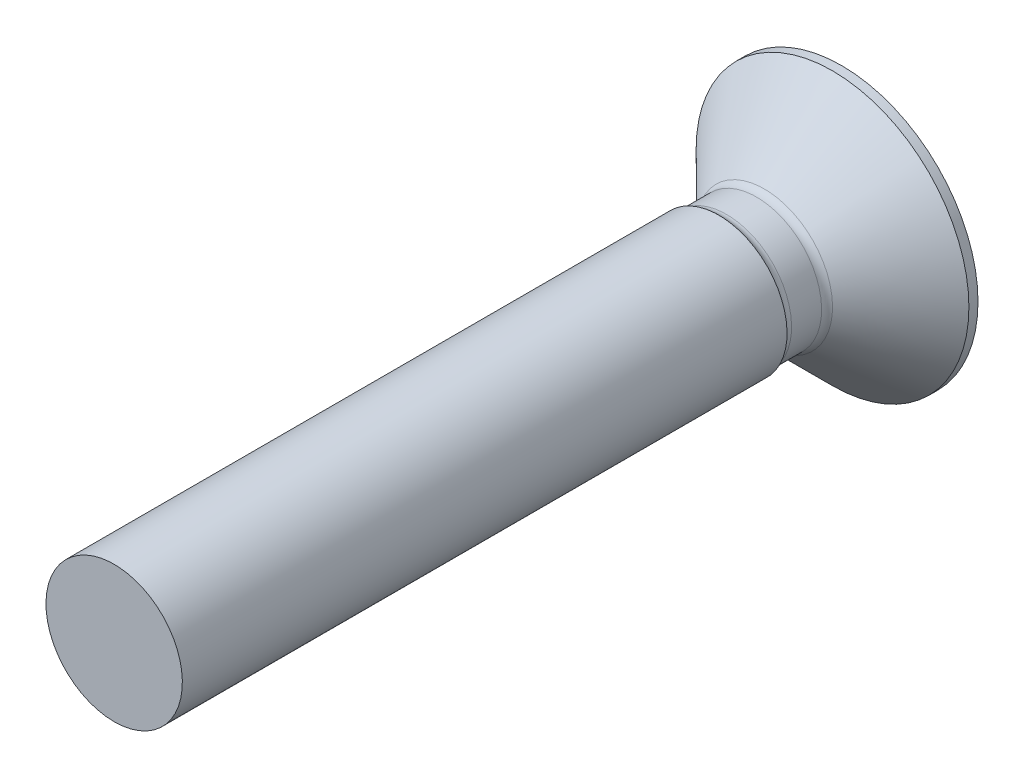
ISO-10303-21;
HEADER;
FILE_DESCRIPTION(('STEP AP214'),'2;1');
FILE_NAME('part.step','',(''),(''),'','','');
FILE_SCHEMA(('AUTOMOTIVE_DESIGN { 1 0 10303 214 1 1 1 1 }'));
ENDSEC;
DATA;
#1=APPLICATION_CONTEXT('core data for automotive mechanical design processes');
#2=APPLICATION_PROTOCOL_DEFINITION('international standard','automotive_design',2000,#1);
#3=PRODUCT_CONTEXT('',#1,'mechanical');
#4=PRODUCT('Part','Part','',(#3));
#5=PRODUCT_RELATED_PRODUCT_CATEGORY('part','',(#4));
#6=PRODUCT_DEFINITION_FORMATION('','',#4);
#7=PRODUCT_DEFINITION_CONTEXT('part definition',#1,'design');
#8=PRODUCT_DEFINITION('design','',#6,#7);
#9=PRODUCT_DEFINITION_SHAPE('','',#8);
#10=(LENGTH_UNIT() NAMED_UNIT(*) SI_UNIT(.MILLI.,.METRE.));
#11=(NAMED_UNIT(*) PLANE_ANGLE_UNIT() SI_UNIT($,.RADIAN.));
#12=(NAMED_UNIT(*) SI_UNIT($,.STERADIAN.) SOLID_ANGLE_UNIT());
#13=UNCERTAINTY_MEASURE_WITH_UNIT(LENGTH_MEASURE(1.E-05),#10,'distance_accuracy_value','');
#14=(GEOMETRIC_REPRESENTATION_CONTEXT(3) GLOBAL_UNCERTAINTY_ASSIGNED_CONTEXT((#13)) GLOBAL_UNIT_ASSIGNED_CONTEXT((#10,
#11,#12)) REPRESENTATION_CONTEXT('',''));
#15=CARTESIAN_POINT('',(0.,0.,0.));
#16=DIRECTION('',(0.,0.,1.));
#17=DIRECTION('',(1.,0.,0.));
#18=AXIS2_PLACEMENT_3D('',#15,#16,#17);
#19=CARTESIAN_POINT('',(0.,-0.75,14.3));
#20=DIRECTION('',(0.,0.,1.));
#21=DIRECTION('',(0.,-1.,0.));
#22=AXIS2_PLACEMENT_3D('',#19,#20,#21);
#23=PLANE('',#22);
#24=CARTESIAN_POINT('',(0.,0.,14.3));
#25=DIRECTION('',(0.,0.,1.));
#26=DIRECTION('',(0.,-1.,0.));
#27=AXIS2_PLACEMENT_3D('',#24,#25,#26);
#28=CIRCLE('',#27,1.5);
#29=CARTESIAN_POINT('',(0.,-1.5,14.3));
#30=VERTEX_POINT('',#29);
#31=EDGE_CURVE('E11',#30,#30,#28,.T.);
#32=ORIENTED_EDGE('',*,*,#31,.T.);
#33=EDGE_LOOP('',(#32));
#34=FACE_BOUND('',#33,.T.);
#35=ADVANCED_FACE('F17',(#34),#23,.T.);
#36=CARTESIAN_POINT('',(0.,0.,7.65));
#37=DIRECTION('',(0.,0.,-1.));
#38=DIRECTION('',(0.,-1.,0.));
#39=AXIS2_PLACEMENT_3D('',#36,#37,#38);
#40=CYLINDRICAL_SURFACE('',#39,1.5);
#41=CARTESIAN_POINT('',(0.,0.,1.));
#42=DIRECTION('',(0.,0.,1.));
#43=DIRECTION('',(0.,-1.,0.));
#44=AXIS2_PLACEMENT_3D('',#41,#42,#43);
#45=CIRCLE('',#44,1.5);
#46=CARTESIAN_POINT('',(0.,-1.5,1.));
#47=VERTEX_POINT('',#46);
#48=EDGE_CURVE('E27',#47,#47,#45,.T.);
#49=ORIENTED_EDGE('',*,*,#48,.T.);
#50=EDGE_LOOP('',(#49));
#51=FACE_BOUND('',#50,.T.);
#52=ORIENTED_EDGE('',*,*,#31,.F.);
#53=EDGE_LOOP('',(#52));
#54=FACE_BOUND('',#53,.T.);
#55=ADVANCED_FACE('F211',(#51,#54),#40,.T.);
#56=CARTESIAN_POINT('',(0.,0.,0.830294372515228));
#57=DIRECTION('',(0.,0.,1.));
#58=DIRECTION('',(-1.,0.,0.));
#59=AXIS2_PLACEMENT_3D('',#56,#57,#58);
#60=TOROIDAL_SURFACE('',#59,1.66970562748478,0.24);
#61=CARTESIAN_POINT('',(0.,0.,0.830294372515229));
#62=DIRECTION('',(0.,0.,1.));
#63=DIRECTION('',(0.,-1.,0.));
#64=AXIS2_PLACEMENT_3D('',#61,#62,#63);
#65=CIRCLE('',#64,1.42970562748477);
#66=CARTESIAN_POINT('',(0.,-1.42970562748477,0.830294372515228));
#67=VERTEX_POINT('',#66);
#68=EDGE_CURVE('E133',#67,#67,#65,.T.);
#69=ORIENTED_EDGE('',*,*,#68,.T.);
#70=EDGE_LOOP('',(#69));
#71=FACE_BOUND('',#70,.T.);
#72=ORIENTED_EDGE('',*,*,#48,.F.);
#73=EDGE_LOOP('',(#72));
#74=FACE_BOUND('',#73,.T.);
#75=ADVANCED_FACE('F217',(#71,#74),#60,.F.);
#76=CARTESIAN_POINT('',(0.,0.,0.5));
#77=DIRECTION('',(0.,0.,-1.));
#78=DIRECTION('',(0.,-1.,0.));
#79=AXIS2_PLACEMENT_3D('',#76,#77,#78);
#80=CYLINDRICAL_SURFACE('',#79,1.42970562748477);
#81=CARTESIAN_POINT('',(0.,0.,0.169705627484771));
#82=DIRECTION('',(0.,0.,1.));
#83=DIRECTION('',(0.,-1.,0.));
#84=AXIS2_PLACEMENT_3D('',#81,#82,#83);
#85=CIRCLE('',#84,1.42970562748477);
#86=CARTESIAN_POINT('',(0.,-1.42970562748477,0.169705627484771));
#87=VERTEX_POINT('',#86);
#88=EDGE_CURVE('E135',#87,#87,#85,.T.);
#89=ORIENTED_EDGE('',*,*,#88,.T.);
#90=EDGE_LOOP('',(#89));
#91=FACE_BOUND('',#90,.T.);
#92=ORIENTED_EDGE('',*,*,#68,.F.);
#93=EDGE_LOOP('',(#92));
#94=FACE_BOUND('',#93,.T.);
#95=ADVANCED_FACE('F224',(#91,#94),#80,.T.);
#96=CARTESIAN_POINT('',(0.,0.,0.169705627484771));
#97=DIRECTION('',(0.,0.,1.));
#98=DIRECTION('',(-1.,0.,0.));
#99=AXIS2_PLACEMENT_3D('',#96,#97,#98);
#100=TOROIDAL_SURFACE('',#99,1.66970562748477,0.24);
#101=CARTESIAN_POINT('',(0.,0.,0.));
#102=DIRECTION('',(0.,0.,1.));
#103=DIRECTION('',(0.,-1.,0.));
#104=AXIS2_PLACEMENT_3D('',#101,#102,#103);
#105=CIRCLE('',#104,1.5);
#106=CARTESIAN_POINT('',(0.,-1.5,0.));
#107=VERTEX_POINT('',#106);
#108=EDGE_CURVE('E153',#107,#107,#105,.T.);
#109=ORIENTED_EDGE('',*,*,#108,.T.);
#110=EDGE_LOOP('',(#109));
#111=FACE_BOUND('',#110,.T.);
#112=ORIENTED_EDGE('',*,*,#88,.F.);
#113=EDGE_LOOP('',(#112));
#114=FACE_BOUND('',#113,.T.);
#115=ADVANCED_FACE('F19',(#111,#114),#100,.F.);
#116=CARTESIAN_POINT('',(0.,0.,-0.75));
#117=DIRECTION('',(0.,0.,-1.));
#118=DIRECTION('',(0.,-1.,0.));
#119=AXIS2_PLACEMENT_3D('',#116,#117,#118);
#120=CONICAL_SURFACE('',#119,2.25,0.785398163397448);
#121=CARTESIAN_POINT('',(0.,0.,-1.5));
#122=DIRECTION('',(0.,0.,1.));
#123=DIRECTION('',(0.,-1.,0.));
#124=AXIS2_PLACEMENT_3D('',#121,#122,#123);
#125=CIRCLE('',#124,3.);
#126=CARTESIAN_POINT('',(0.,-3.,-1.5));
#127=VERTEX_POINT('',#126);
#128=EDGE_CURVE('E128',#127,#127,#125,.T.);
#129=ORIENTED_EDGE('',*,*,#128,.T.);
#130=EDGE_LOOP('',(#129));
#131=FACE_BOUND('',#130,.T.);
#132=ORIENTED_EDGE('',*,*,#108,.F.);
#133=EDGE_LOOP('',(#132));
#134=FACE_BOUND('',#133,.T.);
#135=ADVANCED_FACE('F227',(#131,#134),#120,.T.);
#136=CARTESIAN_POINT('',(0.,0.,-1.6));
#137=DIRECTION('',(0.,0.,-1.));
#138=DIRECTION('',(0.,-1.,0.));
#139=AXIS2_PLACEMENT_3D('',#136,#137,#138);
#140=CYLINDRICAL_SURFACE('',#139,3.);
#141=CARTESIAN_POINT('',(0.,0.,-1.7));
#142=DIRECTION('',(0.,0.,1.));
#143=DIRECTION('',(0.,-1.,0.));
#144=AXIS2_PLACEMENT_3D('',#141,#142,#143);
#145=CIRCLE('',#144,3.);
#146=CARTESIAN_POINT('',(0.,-3.,-1.7));
#147=VERTEX_POINT('',#146);
#148=EDGE_CURVE('E126',#147,#147,#145,.T.);
#149=ORIENTED_EDGE('',*,*,#148,.T.);
#150=EDGE_LOOP('',(#149));
#151=FACE_BOUND('',#150,.T.);
#152=ORIENTED_EDGE('',*,*,#128,.F.);
#153=EDGE_LOOP('',(#152));
#154=FACE_BOUND('',#153,.T.);
#155=ADVANCED_FACE('F229',(#151,#154),#140,.T.);
#156=CARTESIAN_POINT('',(0.,-1.5,-1.7));
#157=DIRECTION('',(0.,0.,-1.));
#158=DIRECTION('',(0.,1.,0.));
#159=AXIS2_PLACEMENT_3D('',#156,#157,#158);
#160=PLANE('',#159);
#161=ORIENTED_EDGE('',*,*,#148,.F.);
#162=EDGE_LOOP('',(#161));
#163=FACE_BOUND('',#162,.T.);
#164=DIRECTION('',(-0.5,-0.866025403784439,0.));
#165=VECTOR('',#164,1.);
#166=CARTESIAN_POINT('',(-1.19100952641916,-0.0623703293144864,-1.7));
#167=LINE('',#166,#165);
#168=CARTESIAN_POINT('',(-0.5775,1.00025934137103,-1.7));
#169=VERTEX_POINT('',#168);
#170=CARTESIAN_POINT('',(-1.155,0.,-1.7));
#171=VERTEX_POINT('',#170);
#172=EDGE_CURVE('E132',#169,#171,#167,.T.);
#173=ORIENTED_EDGE('',*,*,#172,.T.);
#174=DIRECTION('',(0.5,-0.866025403784439,0.));
#175=VECTOR('',#174,1.);
#176=CARTESIAN_POINT('',(-0.541490473580836,-1.06262967068551,-1.7));
#177=LINE('',#176,#175);
#178=CARTESIAN_POINT('',(-0.5775,-1.00025934137103,-1.7));
#179=VERTEX_POINT('',#178);
#180=EDGE_CURVE('E129',#171,#179,#177,.T.);
#181=ORIENTED_EDGE('',*,*,#180,.T.);
#182=DIRECTION('',(1.,0.,0.));
#183=VECTOR('',#182,1.);
#184=CARTESIAN_POINT('',(0.,-1.00025934137103,-1.7));
#185=LINE('',#184,#183);
#186=CARTESIAN_POINT('',(0.5775,-1.00025934137103,-1.7));
#187=VERTEX_POINT('',#186);
#188=EDGE_CURVE('E98',#179,#187,#185,.T.);
#189=ORIENTED_EDGE('',*,*,#188,.T.);
#190=DIRECTION('',(0.5,0.866025403784439,0.));
#191=VECTOR('',#190,1.);
#192=CARTESIAN_POINT('',(0.541490473580836,-1.06262967068551,-1.7));
#193=LINE('',#192,#191);
#194=CARTESIAN_POINT('',(1.155,0.,-1.7));
#195=VERTEX_POINT('',#194);
#196=EDGE_CURVE('E95',#187,#195,#193,.T.);
#197=ORIENTED_EDGE('',*,*,#196,.T.);
#198=DIRECTION('',(-0.5,0.866025403784439,0.));
#199=VECTOR('',#198,1.);
#200=CARTESIAN_POINT('',(1.19100952641916,-0.0623703293144868,-1.7));
#201=LINE('',#200,#199);
#202=CARTESIAN_POINT('',(0.5775,1.00025934137103,-1.7));
#203=VERTEX_POINT('',#202);
#204=EDGE_CURVE('E120',#195,#203,#201,.T.);
#205=ORIENTED_EDGE('',*,*,#204,.T.);
#206=DIRECTION('',(-1.,0.,0.));
#207=VECTOR('',#206,1.);
#208=CARTESIAN_POINT('',(0.,1.00025934137103,-1.7));
#209=LINE('',#208,#207);
#210=EDGE_CURVE('E158',#203,#169,#209,.T.);
#211=ORIENTED_EDGE('',*,*,#210,.T.);
#212=EDGE_LOOP('',(#173,#181,#189,#197,#205,#211));
#213=FACE_BOUND('',#212,.T.);
#214=ADVANCED_FACE('F192',(#163,#213),#160,.T.);
#215=CARTESIAN_POINT('',(-0.86625,-0.500129670685513,-1.7));
#216=DIRECTION('',(-0.866025403784439,-0.5,0.));
#217=DIRECTION('',(0.5,-0.866025403784439,0.));
#218=AXIS2_PLACEMENT_3D('',#215,#216,#217);
#219=PLANE('',#218);
#220=CARTESIAN_POINT('',(-1.155,0.,-0.65));
#221=CARTESIAN_POINT('',(-0.866249999999999,-0.500129670685513,-0.483290109771495));
#222=CARTESIAN_POINT('',(-0.5775,-1.00025934137103,-0.65));
#223=(BOUNDED_CURVE() B_SPLINE_CURVE(2,(#220,#221,#222),.UNSPECIFIED.,.F.,
.F.) B_SPLINE_CURVE_WITH_KNOTS((3,3),(0.,1.16873916190793),
.UNSPECIFIED.) CURVE() GEOMETRIC_REPRESENTATION_ITEM() RATIONAL_B_SPLINE_CURVE((1.,
1.15470053837925,1.)) REPRESENTATION_ITEM(''));
#224=CARTESIAN_POINT('',(-1.155,0.,-0.65));
#225=VERTEX_POINT('',#224);
#226=CARTESIAN_POINT('',(-0.5775,-1.00025934137103,-0.65));
#227=VERTEX_POINT('',#226);
#228=EDGE_CURVE('E107',#225,#227,#223,.T.);
#229=ORIENTED_EDGE('',*,*,#228,.T.);
#230=DIRECTION('',(0.,0.,1.));
#231=VECTOR('',#230,1.);
#232=CARTESIAN_POINT('',(-0.5775,-1.00025934137103,-1.7));
#233=LINE('',#232,#231);
#234=EDGE_CURVE('E103',#179,#227,#233,.T.);
#235=ORIENTED_EDGE('',*,*,#234,.F.);
#236=ORIENTED_EDGE('',*,*,#180,.F.);
#237=DIRECTION('',(0.,0.,1.));
#238=VECTOR('',#237,1.);
#239=CARTESIAN_POINT('',(-1.155,0.,-1.7));
#240=LINE('',#239,#238);
#241=EDGE_CURVE('E130',#171,#225,#240,.T.);
#242=ORIENTED_EDGE('',*,*,#241,.T.);
#243=EDGE_LOOP('',(#229,#235,#236,#242));
#244=FACE_BOUND('',#243,.T.);
#245=ADVANCED_FACE('F190',(#244),#219,.F.);
#246=CARTESIAN_POINT('',(0.,-1.00025934137103,-1.7));
#247=DIRECTION('',(0.,-1.,0.));
#248=DIRECTION('',(1.,0.,0.));
#249=AXIS2_PLACEMENT_3D('',#246,#247,#248);
#250=PLANE('',#249);
#251=CARTESIAN_POINT('',(-0.5775,-1.00025934137103,-0.65));
#252=CARTESIAN_POINT('',(0.,-1.00025934137102,-0.483290109771495));
#253=CARTESIAN_POINT('',(0.5775,-1.00025934137103,-0.65));
#254=(BOUNDED_CURVE() B_SPLINE_CURVE(2,(#251,#252,#253),.UNSPECIFIED.,.F.,
.F.) B_SPLINE_CURVE_WITH_KNOTS((3,3),(0.,1.16873916190793),
.UNSPECIFIED.) CURVE() GEOMETRIC_REPRESENTATION_ITEM() RATIONAL_B_SPLINE_CURVE((1.,
1.15470053837925,1.)) REPRESENTATION_ITEM(''));
#255=CARTESIAN_POINT('',(0.5775,-1.00025934137103,-0.65));
#256=VERTEX_POINT('',#255);
#257=EDGE_CURVE('E100',#227,#256,#254,.T.);
#258=ORIENTED_EDGE('',*,*,#257,.T.);
#259=DIRECTION('',(0.,0.,1.));
#260=VECTOR('',#259,1.);
#261=CARTESIAN_POINT('',(0.5775,-1.00025934137103,-1.7));
#262=LINE('',#261,#260);
#263=EDGE_CURVE('E89',#187,#256,#262,.T.);
#264=ORIENTED_EDGE('',*,*,#263,.F.);
#265=ORIENTED_EDGE('',*,*,#188,.F.);
#266=ORIENTED_EDGE('',*,*,#234,.T.);
#267=EDGE_LOOP('',(#258,#264,#265,#266));
#268=FACE_BOUND('',#267,.T.);
#269=ADVANCED_FACE('F101',(#268),#250,.F.);
#270=CARTESIAN_POINT('',(0.86625,-0.500129670685513,-1.7));
#271=DIRECTION('',(0.866025403784439,-0.5,0.));
#272=DIRECTION('',(0.5,0.866025403784439,0.));
#273=AXIS2_PLACEMENT_3D('',#270,#271,#272);
#274=PLANE('',#273);
#275=CARTESIAN_POINT('',(0.5775,-1.00025934137103,-0.65));
#276=CARTESIAN_POINT('',(0.86625,-0.500129670685511,-0.483290109771496));
#277=CARTESIAN_POINT('',(1.155,0.,-0.65));
#278=(BOUNDED_CURVE() B_SPLINE_CURVE(2,(#275,#276,#277),.UNSPECIFIED.,.F.,
.F.) B_SPLINE_CURVE_WITH_KNOTS((3,3),(0.,1.16873916190792),
.UNSPECIFIED.) CURVE() GEOMETRIC_REPRESENTATION_ITEM() RATIONAL_B_SPLINE_CURVE((1.,
1.15470053837926,1.)) REPRESENTATION_ITEM(''));
#279=CARTESIAN_POINT('',(1.155,0.,-0.65));
#280=VERTEX_POINT('',#279);
#281=EDGE_CURVE('E94',#256,#280,#278,.T.);
#282=ORIENTED_EDGE('',*,*,#281,.T.);
#283=DIRECTION('',(0.,0.,1.));
#284=VECTOR('',#283,1.);
#285=CARTESIAN_POINT('',(1.155,0.,-1.7));
#286=LINE('',#285,#284);
#287=EDGE_CURVE('E125',#195,#280,#286,.T.);
#288=ORIENTED_EDGE('',*,*,#287,.F.);
#289=ORIENTED_EDGE('',*,*,#196,.F.);
#290=ORIENTED_EDGE('',*,*,#263,.T.);
#291=EDGE_LOOP('',(#282,#288,#289,#290));
#292=FACE_BOUND('',#291,.T.);
#293=ADVANCED_FACE('F91',(#292),#274,.F.);
#294=CARTESIAN_POINT('',(0.86625,0.500129670685513,-1.7));
#295=DIRECTION('',(0.866025403784439,0.5,0.));
#296=DIRECTION('',(-0.5,0.866025403784439,0.));
#297=AXIS2_PLACEMENT_3D('',#294,#295,#296);
#298=PLANE('',#297);
#299=CARTESIAN_POINT('',(1.155,0.,-0.65));
#300=CARTESIAN_POINT('',(0.866249999999999,0.500129670685514,-0.483290109771495));
#301=CARTESIAN_POINT('',(0.5775,1.00025934137103,-0.65));
#302=(BOUNDED_CURVE() B_SPLINE_CURVE(2,(#299,#300,#301),.UNSPECIFIED.,.F.,
.F.) B_SPLINE_CURVE_WITH_KNOTS((3,3),(0.,1.16873916190793),
.UNSPECIFIED.) CURVE() GEOMETRIC_REPRESENTATION_ITEM() RATIONAL_B_SPLINE_CURVE((1.,
1.15470053837925,1.)) REPRESENTATION_ITEM(''));
#303=CARTESIAN_POINT('',(0.5775,1.00025934137103,-0.65));
#304=VERTEX_POINT('',#303);
#305=EDGE_CURVE('E113',#280,#304,#302,.T.);
#306=ORIENTED_EDGE('',*,*,#305,.T.);
#307=DIRECTION('',(0.,0.,1.));
#308=VECTOR('',#307,1.);
#309=CARTESIAN_POINT('',(0.5775,1.00025934137103,-1.7));
#310=LINE('',#309,#308);
#311=EDGE_CURVE('E21',#203,#304,#310,.T.);
#312=ORIENTED_EDGE('',*,*,#311,.F.);
#313=ORIENTED_EDGE('',*,*,#204,.F.);
#314=ORIENTED_EDGE('',*,*,#287,.T.);
#315=EDGE_LOOP('',(#306,#312,#313,#314));
#316=FACE_BOUND('',#315,.T.);
#317=ADVANCED_FACE('F199',(#316),#298,.F.);
#318=CARTESIAN_POINT('',(0.,1.00025934137103,-1.7));
#319=DIRECTION('',(0.,1.,0.));
#320=DIRECTION('',(-1.,0.,0.));
#321=AXIS2_PLACEMENT_3D('',#318,#319,#320);
#322=PLANE('',#321);
#323=CARTESIAN_POINT('',(0.5775,1.00025934137103,-0.65));
#324=CARTESIAN_POINT('',(0.,1.00025934137102,-0.483290109771496));
#325=CARTESIAN_POINT('',(-0.5775,1.00025934137103,-0.65));
#326=(BOUNDED_CURVE() B_SPLINE_CURVE(2,(#323,#324,#325),.UNSPECIFIED.,.F.,
.F.) B_SPLINE_CURVE_WITH_KNOTS((3,3),(0.,1.16873916190792),
.UNSPECIFIED.) CURVE() GEOMETRIC_REPRESENTATION_ITEM() RATIONAL_B_SPLINE_CURVE((1.,
1.15470053837926,1.)) REPRESENTATION_ITEM(''));
#327=CARTESIAN_POINT('',(-0.5775,1.00025934137103,-0.65));
#328=VERTEX_POINT('',#327);
#329=EDGE_CURVE('E136',#304,#328,#326,.T.);
#330=ORIENTED_EDGE('',*,*,#329,.T.);
#331=DIRECTION('',(0.,0.,1.));
#332=VECTOR('',#331,1.);
#333=CARTESIAN_POINT('',(-0.5775,1.00025934137103,-1.7));
#334=LINE('',#333,#332);
#335=EDGE_CURVE('E155',#169,#328,#334,.T.);
#336=ORIENTED_EDGE('',*,*,#335,.F.);
#337=ORIENTED_EDGE('',*,*,#210,.F.);
#338=ORIENTED_EDGE('',*,*,#311,.T.);
#339=EDGE_LOOP('',(#330,#336,#337,#338));
#340=FACE_BOUND('',#339,.T.);
#341=ADVANCED_FACE('F197',(#340),#322,.F.);
#342=CARTESIAN_POINT('',(-0.86625,0.500129670685513,-1.7));
#343=DIRECTION('',(-0.866025403784439,0.5,0.));
#344=DIRECTION('',(-0.5,-0.866025403784439,0.));
#345=AXIS2_PLACEMENT_3D('',#342,#343,#344);
#346=PLANE('',#345);
#347=CARTESIAN_POINT('',(-0.5775,1.00025934137103,-0.65));
#348=CARTESIAN_POINT('',(-0.86625,0.50012967068551,-0.483290109771495));
#349=CARTESIAN_POINT('',(-1.155,0.,-0.65));
#350=(BOUNDED_CURVE() B_SPLINE_CURVE(2,(#347,#348,#349),.UNSPECIFIED.,.F.,
.F.) B_SPLINE_CURVE_WITH_KNOTS((3,3),(0.,1.16873916190792),
.UNSPECIFIED.) CURVE() GEOMETRIC_REPRESENTATION_ITEM() RATIONAL_B_SPLINE_CURVE((1.,
1.15470053837926,1.)) REPRESENTATION_ITEM(''));
#351=EDGE_CURVE('E141',#328,#225,#350,.T.);
#352=ORIENTED_EDGE('',*,*,#351,.T.);
#353=ORIENTED_EDGE('',*,*,#241,.F.);
#354=ORIENTED_EDGE('',*,*,#172,.F.);
#355=ORIENTED_EDGE('',*,*,#335,.T.);
#356=EDGE_LOOP('',(#352,#353,#354,#355));
#357=FACE_BOUND('',#356,.T.);
#358=ADVANCED_FACE('F186',(#357),#346,.F.);
#359=CARTESIAN_POINT('',(0.,0.,-0.316580219542991));
#360=DIRECTION('',(0.,0.,-1.));
#361=DIRECTION('',(0.,-1.,0.));
#362=AXIS2_PLACEMENT_3D('',#359,#360,#361);
#363=CONICAL_SURFACE('',#362,0.5775,1.0471975511966);
#364=CARTESIAN_POINT('',(0.,0.,0.016839560914018));
#365=VERTEX_POINT('',#364);
#366=VERTEX_LOOP('',#365);
#367=FACE_BOUND('',#366,.T.);
#368=ORIENTED_EDGE('',*,*,#281,.F.);
#369=ORIENTED_EDGE('',*,*,#257,.F.);
#370=ORIENTED_EDGE('',*,*,#228,.F.);
#371=ORIENTED_EDGE('',*,*,#351,.F.);
#372=ORIENTED_EDGE('',*,*,#329,.F.);
#373=ORIENTED_EDGE('',*,*,#305,.F.);
#374=EDGE_LOOP('',(#368,#369,#370,#371,#372,#373));
#375=FACE_BOUND('',#374,.T.);
#376=ADVANCED_FACE('F110',(#367,#375),#363,.F.);
#377=CLOSED_SHELL('',(#35,#55,#75,#95,#115,#135,#155,#214,#245,#269,#293,#317,#341,#358,#376));
#378=MANIFOLD_SOLID_BREP('B1',#377);
#379=ADVANCED_BREP_SHAPE_REPRESENTATION('',(#18,#378),#14);
#380=SHAPE_DEFINITION_REPRESENTATION(#9,#379);
ENDSEC;
END-ISO-10303-21;
